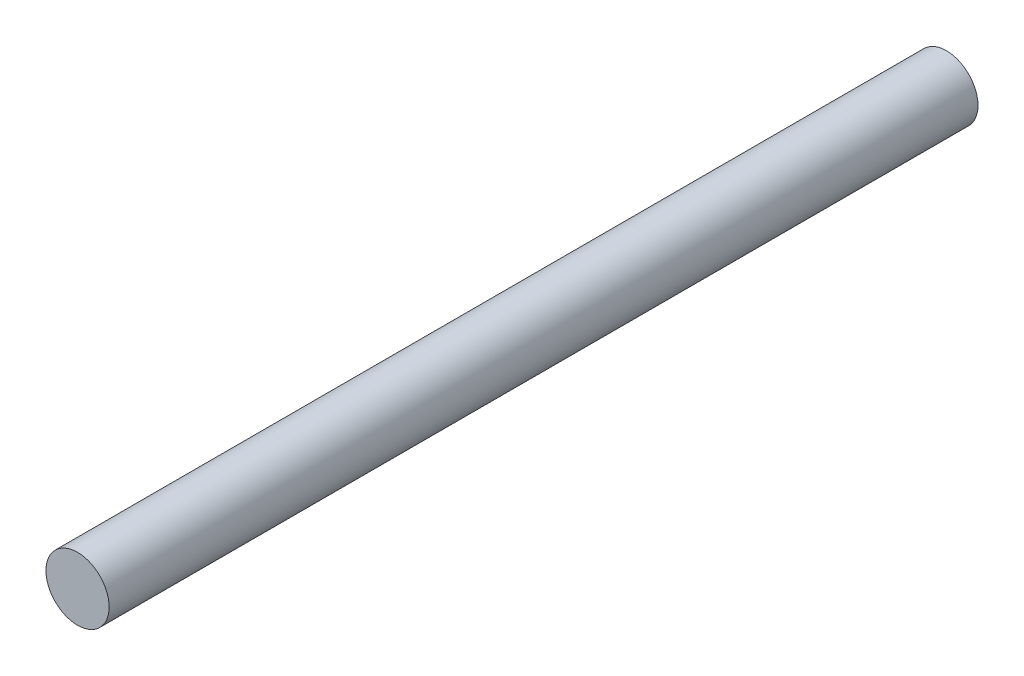
ISO-10303-21;
HEADER;
FILE_DESCRIPTION(('STEP AP214'),'2;1');
FILE_NAME('part.step','',(''),(''),'','','');
FILE_SCHEMA(('AUTOMOTIVE_DESIGN { 1 0 10303 214 1 1 1 1 }'));
ENDSEC;
DATA;
#1=APPLICATION_CONTEXT('core data for automotive mechanical design processes');
#2=APPLICATION_PROTOCOL_DEFINITION('international standard','automotive_design',2000,#1);
#3=PRODUCT_CONTEXT('',#1,'mechanical');
#4=PRODUCT('Part','Part','',(#3));
#5=PRODUCT_RELATED_PRODUCT_CATEGORY('part','',(#4));
#6=PRODUCT_DEFINITION_FORMATION('','',#4);
#7=PRODUCT_DEFINITION_CONTEXT('part definition',#1,'design');
#8=PRODUCT_DEFINITION('design','',#6,#7);
#9=PRODUCT_DEFINITION_SHAPE('','',#8);
#10=(LENGTH_UNIT() NAMED_UNIT(*) SI_UNIT(.MILLI.,.METRE.));
#11=(NAMED_UNIT(*) PLANE_ANGLE_UNIT() SI_UNIT($,.RADIAN.));
#12=(NAMED_UNIT(*) SI_UNIT($,.STERADIAN.) SOLID_ANGLE_UNIT());
#13=UNCERTAINTY_MEASURE_WITH_UNIT(LENGTH_MEASURE(1.E-05),#10,'distance_accuracy_value','');
#14=(GEOMETRIC_REPRESENTATION_CONTEXT(3) GLOBAL_UNCERTAINTY_ASSIGNED_CONTEXT((#13)) GLOBAL_UNIT_ASSIGNED_CONTEXT((#10,
#11,#12)) REPRESENTATION_CONTEXT('',''));
#15=CARTESIAN_POINT('',(0.,0.,0.));
#16=DIRECTION('',(0.,0.,1.));
#17=DIRECTION('',(1.,0.,0.));
#18=AXIS2_PLACEMENT_3D('',#15,#16,#17);
#19=CARTESIAN_POINT('',(0.,0.,110.));
#20=DIRECTION('',(0.,0.,-1.));
#21=DIRECTION('',(-1.,0.,0.));
#22=AXIS2_PLACEMENT_3D('',#19,#20,#21);
#23=CYLINDRICAL_SURFACE('',#22,4.);
#24=CARTESIAN_POINT('',(0.,0.,110.));
#25=DIRECTION('',(0.,0.,1.));
#26=DIRECTION('',(1.,0.,0.));
#27=AXIS2_PLACEMENT_3D('',#24,#25,#26);
#28=CIRCLE('',#27,4.);
#29=CARTESIAN_POINT('',(4.,0.,110.));
#30=VERTEX_POINT('',#29);
#31=EDGE_CURVE('E12',#30,#30,#28,.T.);
#32=ORIENTED_EDGE('',*,*,#31,.F.);
#33=EDGE_LOOP('',(#32));
#34=FACE_BOUND('',#33,.T.);
#35=CARTESIAN_POINT('',(0.,0.,0.));
#36=DIRECTION('',(0.,0.,1.));
#37=DIRECTION('',(1.,0.,0.));
#38=AXIS2_PLACEMENT_3D('',#35,#36,#37);
#39=CIRCLE('',#38,4.);
#40=CARTESIAN_POINT('',(4.,0.,0.));
#41=VERTEX_POINT('',#40);
#42=EDGE_CURVE('E43',#41,#41,#39,.T.);
#43=ORIENTED_EDGE('',*,*,#42,.T.);
#44=EDGE_LOOP('',(#43));
#45=FACE_BOUND('',#44,.T.);
#46=ADVANCED_FACE('F40',(#34,#45),#23,.T.);
#47=CARTESIAN_POINT('',(0.,0.,110.));
#48=DIRECTION('',(0.,0.,1.));
#49=DIRECTION('',(1.,0.,0.));
#50=AXIS2_PLACEMENT_3D('',#47,#48,#49);
#51=PLANE('',#50);
#52=ORIENTED_EDGE('',*,*,#31,.T.);
#53=EDGE_LOOP('',(#52));
#54=FACE_BOUND('',#53,.T.);
#55=ADVANCED_FACE('F55',(#54),#51,.T.);
#56=CARTESIAN_POINT('',(0.,0.,0.));
#57=DIRECTION('',(0.,0.,1.));
#58=DIRECTION('',(1.,0.,0.));
#59=AXIS2_PLACEMENT_3D('',#56,#57,#58);
#60=PLANE('',#59);
#61=ORIENTED_EDGE('',*,*,#42,.F.);
#62=EDGE_LOOP('',(#61));
#63=FACE_BOUND('',#62,.T.);
#64=ADVANCED_FACE('F53',(#63),#60,.F.);
#65=CLOSED_SHELL('',(#46,#55,#64));
#66=MANIFOLD_SOLID_BREP('B2',#65);
#67=ADVANCED_BREP_SHAPE_REPRESENTATION('',(#18,#66),#14);
#68=SHAPE_DEFINITION_REPRESENTATION(#9,#67);
ENDSEC;
END-ISO-10303-21;
